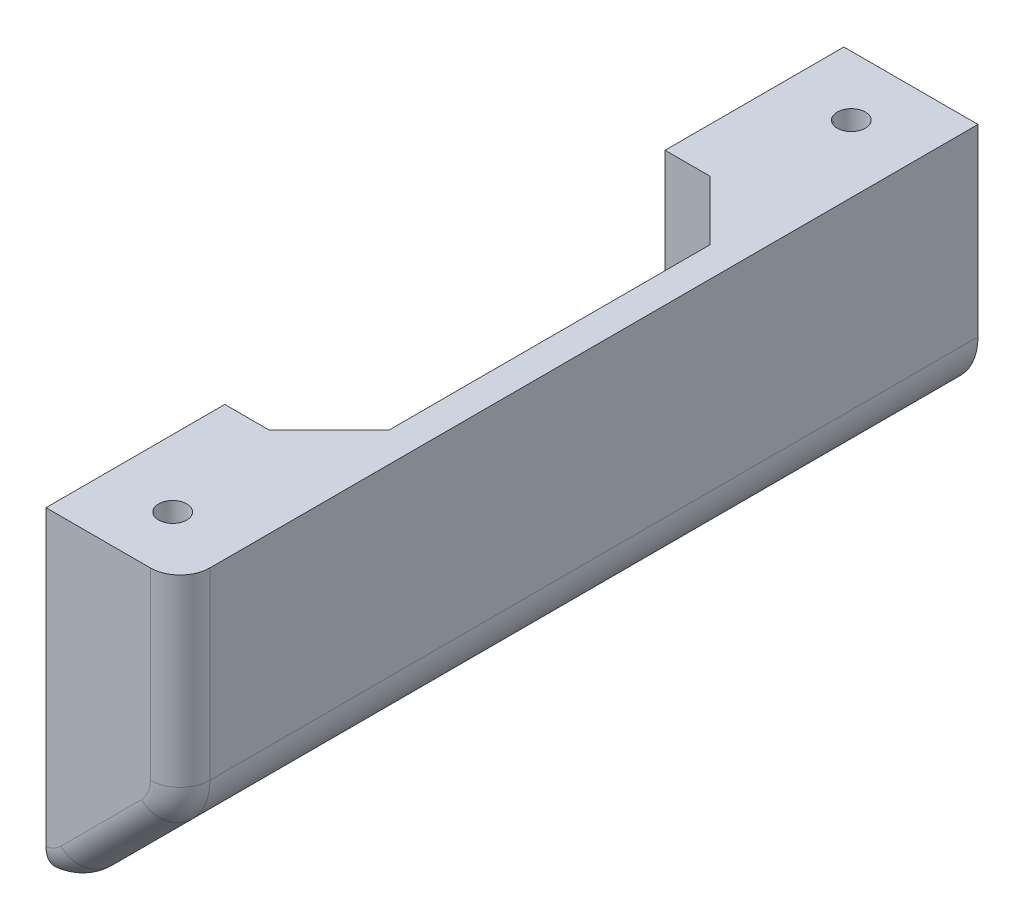
ISO-10303-21;
HEADER;
FILE_DESCRIPTION(('STEP AP214'),'2;1');
FILE_NAME('part.step','',(''),(''),'','','');
FILE_SCHEMA(('AUTOMOTIVE_DESIGN { 1 0 10303 214 1 1 1 1 }'));
ENDSEC;
DATA;
#1=APPLICATION_CONTEXT('core data for automotive mechanical design processes');
#2=APPLICATION_PROTOCOL_DEFINITION('international standard','automotive_design',2000,#1);
#3=PRODUCT_CONTEXT('',#1,'mechanical');
#4=PRODUCT('Part','Part','',(#3));
#5=PRODUCT_RELATED_PRODUCT_CATEGORY('part','',(#4));
#6=PRODUCT_DEFINITION_FORMATION('','',#4);
#7=PRODUCT_DEFINITION_CONTEXT('part definition',#1,'design');
#8=PRODUCT_DEFINITION('design','',#6,#7);
#9=PRODUCT_DEFINITION_SHAPE('','',#8);
#10=(LENGTH_UNIT() NAMED_UNIT(*) SI_UNIT(.MILLI.,.METRE.));
#11=(NAMED_UNIT(*) PLANE_ANGLE_UNIT() SI_UNIT($,.RADIAN.));
#12=(NAMED_UNIT(*) SI_UNIT($,.STERADIAN.) SOLID_ANGLE_UNIT());
#13=UNCERTAINTY_MEASURE_WITH_UNIT(LENGTH_MEASURE(1.E-05),#10,'distance_accuracy_value','');
#14=(GEOMETRIC_REPRESENTATION_CONTEXT(3) GLOBAL_UNCERTAINTY_ASSIGNED_CONTEXT((#13)) GLOBAL_UNIT_ASSIGNED_CONTEXT((#10,
#11,#12)) REPRESENTATION_CONTEXT('',''));
#15=CARTESIAN_POINT('',(0.,0.,0.));
#16=DIRECTION('',(0.,0.,1.));
#17=DIRECTION('',(1.,0.,0.));
#18=AXIS2_PLACEMENT_3D('',#15,#16,#17);
#19=CARTESIAN_POINT('',(-231.304465963193,68.999999999995,244.682867011122));
#20=DIRECTION('',(0.,-1.00000000000002,0.));
#21=DIRECTION('',(0.,0.,-1.00000000000003));
#22=AXIS2_PLACEMENT_3D('',#19,#20,#21);
#23=PLANE('',#22);
#24=CARTESIAN_POINT('',(-217.016965963193,69.0000000000029,12.6999999999988));
#25=DIRECTION('',(0.,1.00000000000002,0.));
#26=DIRECTION('',(0.,0.,1.00000000000003));
#27=AXIS2_PLACEMENT_3D('',#24,#25,#26);
#28=CIRCLE('',#27,2.99720000000001);
#29=CARTESIAN_POINT('',(-217.016965963193,69.0000000000028,15.6971999999989));
#30=VERTEX_POINT('',#29);
#31=EDGE_CURVE('E205',#30,#30,#28,.T.);
#32=ORIENTED_EDGE('',*,*,#31,.F.);
#33=EDGE_LOOP('',(#32));
#34=FACE_BOUND('',#33,.T.);
#35=CARTESIAN_POINT('',(-217.016965963193,68.9999999999994,157.300000000004));
#36=DIRECTION('',(0.,1.00000000000002,0.));
#37=DIRECTION('',(0.,0.,1.00000000000003));
#38=AXIS2_PLACEMENT_3D('',#35,#36,#37);
#39=CIRCLE('',#38,2.99720000000001);
#40=CARTESIAN_POINT('',(-217.016965963193,68.9999999999993,160.297200000004));
#41=VERTEX_POINT('',#40);
#42=EDGE_CURVE('E211',#41,#41,#39,.T.);
#43=ORIENTED_EDGE('',*,*,#42,.F.);
#44=EDGE_LOOP('',(#43));
#45=FACE_BOUND('',#44,.T.);
#46=DIRECTION('',(0.,0.,-1.00000000000003));
#47=VECTOR('',#46,1.);
#48=CARTESIAN_POINT('',(-209.079465963193,68.9999999999969,244.682867011122));
#49=LINE('',#48,#47);
#50=CARTESIAN_POINT('',(-209.079465963193,69.0000000000001,119.200000000002));
#51=VERTEX_POINT('',#50);
#52=CARTESIAN_POINT('',(-209.079465963193,69.0000000000029,50.7999999999996));
#53=VERTEX_POINT('',#52);
#54=EDGE_CURVE('E237',#51,#53,#49,.T.);
#55=ORIENTED_EDGE('',*,*,#54,.F.);
#56=DIRECTION('',(0.707106781186542,0.,-0.707106781186572));
#57=VECTOR('',#56,1.);
#58=CARTESIAN_POINT('',(-282.933399468751,68.9999999999973,193.053933505564));
#59=LINE('',#58,#57);
#60=CARTESIAN_POINT('',(-221.779465963192,68.9999999999998,131.900000000002));
#61=VERTEX_POINT('',#60);
#62=EDGE_CURVE('E390',#51,#61,#59,.F.);
#63=ORIENTED_EDGE('',*,*,#62,.T.);
#64=DIRECTION('',(-1.,0.,0.));
#65=VECTOR('',#64,1.);
#66=CARTESIAN_POINT('',(-202.727465963193,69.0000000000003,131.900000000003));
#67=LINE('',#66,#65);
#68=CARTESIAN_POINT('',(-231.304465963193,68.9999999999986,131.900000000003));
#69=VERTEX_POINT('',#68);
#70=EDGE_CURVE('E220',#61,#69,#67,.T.);
#71=ORIENTED_EDGE('',*,*,#70,.T.);
#72=DIRECTION('',(0.,0.,-1.00000000000003));
#73=VECTOR('',#72,1.);
#74=CARTESIAN_POINT('',(-231.304465963193,68.999999999995,244.682867011122));
#75=LINE('',#74,#73);
#76=CARTESIAN_POINT('',(-231.304465963193,68.9999999999969,170.000000000003));
#77=VERTEX_POINT('',#76);
#78=EDGE_CURVE('E252',#77,#69,#75,.T.);
#79=ORIENTED_EDGE('',*,*,#78,.F.);
#80=DIRECTION('',(-1.,0.,0.));
#81=VECTOR('',#80,1.);
#82=CARTESIAN_POINT('',(-231.304465963193,68.9999999999969,170.000000000003));
#83=LINE('',#82,#81);
#84=CARTESIAN_POINT('',(-209.079465963193,68.9999999999999,170.000000000003));
#85=VERTEX_POINT('',#84);
#86=EDGE_CURVE('E244',#85,#77,#83,.T.);
#87=ORIENTED_EDGE('',*,*,#86,.F.);
#88=CARTESIAN_POINT('',(-209.079465963193,68.9999999999999,163.650000000003));
#89=DIRECTION('',(0.,-1.00000000000002,0.));
#90=DIRECTION('',(0.,0.,-1.00000000000003));
#91=AXIS2_PLACEMENT_3D('',#88,#89,#90);
#92=CIRCLE('',#91,6.35);
#93=CARTESIAN_POINT('',(-202.729465963193,68.9999999999999,163.650000000003));
#94=VERTEX_POINT('',#93);
#95=EDGE_CURVE('E286',#85,#94,#92,.F.);
#96=ORIENTED_EDGE('',*,*,#95,.T.);
#97=DIRECTION('',(0.,0.,-1.00000000000003));
#98=VECTOR('',#97,1.);
#99=CARTESIAN_POINT('',(-202.729465963193,68.9999999999974,244.682867011123));
#100=LINE('',#99,#98);
#101=CARTESIAN_POINT('',(-202.729465963193,69.0000000000031,-2.3037127760972E-12));
#102=VERTEX_POINT('',#101);
#103=EDGE_CURVE('E235',#94,#102,#100,.T.);
#104=ORIENTED_EDGE('',*,*,#103,.T.);
#105=DIRECTION('',(-1.,0.,0.));
#106=VECTOR('',#105,1.);
#107=CARTESIAN_POINT('',(-231.304465963193,69.0000000000003,-2.02615701994091E-12));
#108=LINE('',#107,#106);
#109=CARTESIAN_POINT('',(-231.304465963193,69.0000000000003,-2.02615701994091E-12));
#110=VERTEX_POINT('',#109);
#111=EDGE_CURVE('E253',#102,#110,#108,.T.);
#112=ORIENTED_EDGE('',*,*,#111,.T.);
#113=CARTESIAN_POINT('',(-231.304465963193,69.0000000000006,38.0999999999994));
#114=VERTEX_POINT('',#113);
#115=EDGE_CURVE('E256',#114,#110,#75,.T.);
#116=ORIENTED_EDGE('',*,*,#115,.F.);
#117=DIRECTION('',(-1.,0.,0.));
#118=VECTOR('',#117,1.);
#119=CARTESIAN_POINT('',(-202.727465963193,69.0000000000007,38.0999999999996));
#120=LINE('',#119,#118);
#121=CARTESIAN_POINT('',(-221.779465963193,69.0000000000007,38.0999999999994));
#122=VERTEX_POINT('',#121);
#123=EDGE_CURVE('E222',#122,#114,#120,.T.);
#124=ORIENTED_EDGE('',*,*,#123,.F.);
#125=DIRECTION('',(-0.707106781186545,0.,-0.707106781186574));
#126=VECTOR('',#125,1.);
#127=CARTESIAN_POINT('',(-123.250532457634,68.9999999999997,136.628933505562));
#128=LINE('',#127,#126);
#129=EDGE_CURVE('E11',#122,#53,#128,.F.);
#130=ORIENTED_EDGE('',*,*,#129,.T.);
#131=EDGE_LOOP('',(#55,#63,#71,#79,#87,#96,#104,#112,#116,#124,#130));
#132=FACE_BOUND('',#131,.T.);
#133=ADVANCED_FACE('F38',(#34,#45,#132),#23,.F.);
#134=CARTESIAN_POINT('',(-231.304465963193,-5.99520433297585E-12,244.682867011125));
#135=DIRECTION('',(1.,0.,0.));
#136=DIRECTION('',(0.,0.,-1.00000000000003));
#137=AXIS2_PLACEMENT_3D('',#134,#135,#136);
#138=PLANE('',#137);
#139=CARTESIAN_POINT('',(-231.304465963193,34.4999999999966,141.425000000004));
#140=DIRECTION('',(-1.,0.,0.));
#141=DIRECTION('',(0.,0.,1.00000000000003));
#142=AXIS2_PLACEMENT_3D('',#139,#140,#141);
#143=CIRCLE('',#142,2.99720000000001);
#144=CARTESIAN_POINT('',(-231.304465963193,34.4999999999966,144.422200000004));
#145=VERTEX_POINT('',#144);
#146=EDGE_CURVE('E185',#145,#145,#143,.T.);
#147=ORIENTED_EDGE('',*,*,#146,.F.);
#148=EDGE_LOOP('',(#147));
#149=FACE_BOUND('',#148,.T.);
#150=CARTESIAN_POINT('',(-231.304465963193,34.5000000000005,19.0499999999998));
#151=DIRECTION('',(-1.,0.,0.));
#152=DIRECTION('',(0.,0.,1.00000000000003));
#153=AXIS2_PLACEMENT_3D('',#150,#151,#152);
#154=CIRCLE('',#153,2.99720000000001);
#155=CARTESIAN_POINT('',(-231.304465963193,34.5000000000004,22.0471999999999));
#156=VERTEX_POINT('',#155);
#157=EDGE_CURVE('E191',#156,#156,#154,.T.);
#158=ORIENTED_EDGE('',*,*,#157,.F.);
#159=EDGE_LOOP('',(#158));
#160=FACE_BOUND('',#159,.T.);
#161=DIRECTION('',(0.,-1.00000000000002,0.));
#162=VECTOR('',#161,1.);
#163=CARTESIAN_POINT('',(-231.304465963193,68.9999999999986,131.900000000003));
#164=LINE('',#163,#162);
#165=CARTESIAN_POINT('',(-231.304465963193,22.9157683632041,131.900000000004));
#166=VERTEX_POINT('',#165);
#167=EDGE_CURVE('E217',#69,#166,#164,.T.);
#168=ORIENTED_EDGE('',*,*,#167,.T.);
#169=DIRECTION('',(0.,0.816496580927722,0.577350269189628));
#170=VECTOR('',#169,1.);
#171=CARTESIAN_POINT('',(-231.304465963193,60.8049428312139,158.691692199893));
#172=LINE('',#171,#170);
#173=CARTESIAN_POINT('',(-231.304465963193,6.34999999999841,120.186232854813));
#174=VERTEX_POINT('',#173);
#175=EDGE_CURVE('E388',#166,#174,#172,.F.);
#176=ORIENTED_EDGE('',*,*,#175,.T.);
#177=DIRECTION('',(0.,0.,-1.00000000000003));
#178=VECTOR('',#177,1.);
#179=CARTESIAN_POINT('',(-231.304465963193,6.34999999999414,244.682867011124));
#180=LINE('',#179,#178);
#181=CARTESIAN_POINT('',(-231.304465963193,6.35000000000058,49.8137671451917));
#182=VERTEX_POINT('',#181);
#183=EDGE_CURVE('E232',#174,#182,#180,.T.);
#184=ORIENTED_EDGE('',*,*,#183,.T.);
#185=DIRECTION('',(0.,-0.816496580927757,0.577350269189665));
#186=VECTOR('',#185,1.);
#187=CARTESIAN_POINT('',(-231.304465963193,-89.7455079726159,117.763552474195));
#188=LINE('',#187,#186);
#189=CARTESIAN_POINT('',(-231.304465963193,22.9157683632074,38.1000000000012));
#190=VERTEX_POINT('',#189);
#191=EDGE_CURVE('E47',#182,#190,#188,.F.);
#192=ORIENTED_EDGE('',*,*,#191,.T.);
#193=DIRECTION('',(0.,1.00000000000002,0.));
#194=VECTOR('',#193,1.);
#195=CARTESIAN_POINT('',(-231.304465963193,69.0000000000006,38.0999999999994));
#196=LINE('',#195,#194);
#197=EDGE_CURVE('E223',#190,#114,#196,.T.);
#198=ORIENTED_EDGE('',*,*,#197,.T.);
#199=ORIENTED_EDGE('',*,*,#115,.T.);
#200=DIRECTION('',(0.,-1.00000000000002,0.));
#201=VECTOR('',#200,1.);
#202=CARTESIAN_POINT('',(-231.304465963193,-1.83186799063151E-12,-4.44089209850063E-13));
#203=LINE('',#202,#201);
#204=CARTESIAN_POINT('',(-231.304465963193,-1.83186799063151E-12,-4.44089209850063E-13));
#205=VERTEX_POINT('',#204);
#206=EDGE_CURVE('E249',#110,#205,#203,.T.);
#207=ORIENTED_EDGE('',*,*,#206,.T.);
#208=DIRECTION('',(0.,0.,-1.00000000000003));
#209=VECTOR('',#208,1.);
#210=CARTESIAN_POINT('',(-231.304465963193,-5.99520433297585E-12,244.682867011125));
#211=LINE('',#210,#209);
#212=CARTESIAN_POINT('',(-231.304465963193,-4.27435864480685E-12,163.650000000006));
#213=VERTEX_POINT('',#212);
#214=EDGE_CURVE('E248',#213,#205,#211,.T.);
#215=ORIENTED_EDGE('',*,*,#214,.F.);
#216=CARTESIAN_POINT('',(-231.304465963193,-4.27435864480685E-12,163.650000000006));
#217=CARTESIAN_POINT('',(-231.304465963193,-1.94645770757467E-05,163.827803696936));
#218=CARTESIAN_POINT('',(-231.304465963193,0.00750667465530277,164.005604471068));
#219=CARTESIAN_POINT('',(-231.304465963193,0.0375094933216349,164.359930980728));
#220=CARTESIAN_POINT('',(-231.304465963193,0.0599853722420327,164.536456784015));
#221=CARTESIAN_POINT('',(-231.304465963193,0.119721245651942,164.886832228509));
#222=CARTESIAN_POINT('',(-231.304465963193,0.156968465712378,165.060684047614));
#223=CARTESIAN_POINT('',(-231.304465963193,0.245971625259334,165.404630889584));
#224=CARTESIAN_POINT('',(-231.304465963193,0.297727401614616,165.574725954666));
#225=CARTESIAN_POINT('',(-231.304465963193,0.415391932509909,165.91000029629));
#226=CARTESIAN_POINT('',(-231.304465963193,0.481304540635156,166.075178220385));
#227=CARTESIAN_POINT('',(-231.304465963193,0.626825096140965,166.399459779302));
#228=CARTESIAN_POINT('',(-231.304465963193,0.706438076853262,166.558561155338));
#229=CARTESIAN_POINT('',(-231.304465963193,0.878739451229018,166.869448719972));
#230=CARTESIAN_POINT('',(-231.304465963193,0.971423457824445,167.021237340132));
#231=CARTESIAN_POINT('',(-231.304465963193,1.1692218431034,167.316491773834));
#232=CARTESIAN_POINT('',(-231.304465963193,1.27433652144187,167.459957386616));
#233=CARTESIAN_POINT('',(-231.304465963193,1.49639703833522,167.737755205205));
#234=CARTESIAN_POINT('',(-231.304465963193,1.61335952648075,167.872074101573));
#235=CARTESIAN_POINT('',(-231.304465963193,1.8581490779321,168.130416736262));
#236=CARTESIAN_POINT('',(-231.304465963192,1.98597615876931,168.25444045797));
#237=CARTESIAN_POINT('',(-231.304465963193,2.25159440056227,168.491349975785));
#238=CARTESIAN_POINT('',(-231.304465963193,2.38938684412215,168.60423433375));
#239=CARTESIAN_POINT('',(-231.304465963192,2.67393253722205,168.818073507177));
#240=CARTESIAN_POINT('',(-231.30446596319,2.82068567265383,168.919028474504));
#241=CARTESIAN_POINT('',(-231.30446596319,3.12285855333904,169.108802472057));
#242=CARTESIAN_POINT('',(-231.304465963192,3.27831774549394,169.197558695213));
#243=CARTESIAN_POINT('',(-231.304465963193,3.59606019387105,169.361721397575));
#244=CARTESIAN_POINT('',(-231.304465963193,3.75834108404915,169.437132458914));
#245=CARTESIAN_POINT('',(-231.304465963192,4.08862458887821,169.574158611998));
#246=CARTESIAN_POINT('',(-231.304465963193,4.25662696477025,169.635774278617));
#247=CARTESIAN_POINT('',(-231.304465963193,4.59710267552029,169.744829591519));
#248=CARTESIAN_POINT('',(-231.304465963193,4.76957507651727,169.792272173255));
#249=CARTESIAN_POINT('',(-231.304465963193,5.18540606108045,169.888337439605));
#250=CARTESIAN_POINT('',(-231.304465963193,5.43035077198521,169.930302426443));
#251=CARTESIAN_POINT('',(-231.304465963193,5.79978470029608,169.972170078542));
#252=CARTESIAN_POINT('',(-231.304465963193,5.92318413234367,169.982612703534));
#253=CARTESIAN_POINT('',(-231.304465963193,6.17039476212908,169.996527939177));
#254=CARTESIAN_POINT('',(-231.304465963193,6.29420601995016,169.999999483697));
#255=CARTESIAN_POINT('',(-231.304465963193,6.4180481275008,170.000000000005));
#256=B_SPLINE_CURVE_WITH_KNOTS('',3,(#216,#217,#218,#219,#220,#221,#222,#223,#224,#225,#226,
#227,#228,#229,#230,#231,#232,#233,#234,#235,#236,#237,#238,#239,#240,#241,#242,#243,#244,#245,
#246,#247,#248,#249,#250,#251,#252,#253,#254,#255),.UNSPECIFIED.,.F.,.F.,(4,2,2,2,2,2,2,2,2,2,2,
2,2,2,2,2,2,2,2,4),(0.,0.533247724383543,1.06646689725518,1.59922593802521,2.13197898880193,
2.66487724276656,3.19797169595402,3.73088764898342,4.26381645115453,4.79750484489828,
5.33119409983196,5.86495216655266,6.39870343764889,6.93510736260423,7.47132675147941,
8.00752379114796,8.5436096994168,9.28729610396529,9.65865392644171,10.0300685386412),.UNSPECIFIED.);
#257=CARTESIAN_POINT('',(-231.304465963193,6.4180481275008,170.000000000005));
#258=VERTEX_POINT('',#257);
#259=EDGE_CURVE('E296',#213,#258,#256,.T.);
#260=ORIENTED_EDGE('',*,*,#259,.T.);
#261=DIRECTION('',(0.,-1.00000000000002,0.));
#262=VECTOR('',#261,1.);
#263=CARTESIAN_POINT('',(-231.304465963193,-3.5527136788005E-12,170.000000000006));
#264=LINE('',#263,#262);
#265=EDGE_CURVE('E257',#77,#258,#264,.T.);
#266=ORIENTED_EDGE('',*,*,#265,.F.);
#267=ORIENTED_EDGE('',*,*,#78,.T.);
#268=EDGE_LOOP('',(#168,#176,#184,#192,#198,#199,#207,#215,#260,#266,#267));
#269=FACE_BOUND('',#268,.T.);
#270=ADVANCED_FACE('F310',(#149,#160,#269),#138,.F.);
#271=CARTESIAN_POINT('',(-202.729465963193,24.5499999999985,244.682867011124));
#272=DIRECTION('',(-0.707106781186537,0.70710678118656,0.));
#273=DIRECTION('',(-0.70710678118656,-0.707106781186568,0.));
#274=AXIS2_PLACEMENT_3D('',#271,#272,#273);
#275=PLANE('',#274);
#276=DIRECTION('',(0.,0.,-1.00000000000003));
#277=VECTOR('',#276,1.);
#278=CARTESIAN_POINT('',(-206.449209842123,20.8302561210645,244.682867011124));
#279=LINE('',#278,#277);
#280=CARTESIAN_POINT('',(-206.449209842124,20.8302561210723,-6.38378239159465E-13));
#281=VERTEX_POINT('',#280);
#282=CARTESIAN_POINT('',(-206.449209842123,20.8302561210666,163.650000000004));
#283=VERTEX_POINT('',#282);
#284=EDGE_CURVE('E274',#281,#283,#279,.F.);
#285=ORIENTED_EDGE('',*,*,#284,.T.);
#286=DIRECTION('',(0.70710678118656,0.707106781186568,0.));
#287=VECTOR('',#286,1.);
#288=CARTESIAN_POINT('',(-223.626687979078,3.65277798411262,163.650000000005));
#289=LINE('',#288,#287);
#290=CARTESIAN_POINT('',(-223.626687979078,3.6527779841124,163.650000000005));
#291=VERTEX_POINT('',#290);
#292=EDGE_CURVE('E292',#283,#291,#289,.F.);
#293=ORIENTED_EDGE('',*,*,#292,.T.);
#294=DIRECTION('',(0.,0.,-1.00000000000003));
#295=VECTOR('',#294,1.);
#296=CARTESIAN_POINT('',(-223.626687979078,3.65277798411068,244.682867011124));
#297=LINE('',#296,#295);
#298=CARTESIAN_POINT('',(-223.626687979079,3.65277798411751,-3.88578058618805E-13));
#299=VERTEX_POINT('',#298);
#300=EDGE_CURVE('E272',#291,#299,#297,.T.);
#301=ORIENTED_EDGE('',*,*,#300,.T.);
#302=DIRECTION('',(0.70710678118656,0.707106781186568,0.));
#303=VECTOR('',#302,1.);
#304=CARTESIAN_POINT('',(-202.729465963193,24.5500000000023,-1.11022302462516E-13));
#305=LINE('',#304,#303);
#306=EDGE_CURVE('E245',#299,#281,#305,.T.);
#307=ORIENTED_EDGE('',*,*,#306,.T.);
#308=EDGE_LOOP('',(#285,#293,#301,#307));
#309=FACE_BOUND('',#308,.T.);
#310=ADVANCED_FACE('F315',(#309),#275,.F.);
#311=CARTESIAN_POINT('',(-202.729465963193,68.9999999999974,244.682867011123));
#312=DIRECTION('',(-1.,0.,0.));
#313=DIRECTION('',(0.,-1.00000000000002,0.));
#314=AXIS2_PLACEMENT_3D('',#311,#312,#313);
#315=PLANE('',#314);
#316=ORIENTED_EDGE('',*,*,#103,.F.);
#317=DIRECTION('',(0.,1.00000000000002,0.));
#318=VECTOR('',#317,1.);
#319=CARTESIAN_POINT('',(-202.72946596319,29.8105122421354,163.650000000004));
#320=LINE('',#319,#318);
#321=CARTESIAN_POINT('',(-202.72946596319,29.8105122421354,163.650000000004));
#322=VERTEX_POINT('',#321);
#323=EDGE_CURVE('E288',#94,#322,#320,.F.);
#324=ORIENTED_EDGE('',*,*,#323,.T.);
#325=DIRECTION('',(0.,0.,-1.00000000000003));
#326=VECTOR('',#325,1.);
#327=CARTESIAN_POINT('',(-202.729465963193,29.8105122421351,244.682867011124));
#328=LINE('',#327,#326);
#329=CARTESIAN_POINT('',(-202.729465963193,29.8105122421405,-1.08246744900953E-12));
#330=VERTEX_POINT('',#329);
#331=EDGE_CURVE('E260',#322,#330,#328,.T.);
#332=ORIENTED_EDGE('',*,*,#331,.T.);
#333=DIRECTION('',(0.,1.00000000000002,0.));
#334=VECTOR('',#333,1.);
#335=CARTESIAN_POINT('',(-202.729465963193,69.0000000000031,-2.3037127760972E-12));
#336=LINE('',#335,#334);
#337=EDGE_CURVE('E241',#330,#102,#336,.T.);
#338=ORIENTED_EDGE('',*,*,#337,.T.);
#339=EDGE_LOOP('',(#316,#324,#332,#338));
#340=FACE_BOUND('',#339,.T.);
#341=ADVANCED_FACE('F421',(#340),#315,.F.);
#342=CARTESIAN_POINT('',(0.,0.,0.));
#343=DIRECTION('',(0.,0.,-1.00000000000003));
#344=DIRECTION('',(-1.,0.,0.));
#345=AXIS2_PLACEMENT_3D('',#342,#343,#344);
#346=PLANE('',#345);
#347=ORIENTED_EDGE('',*,*,#337,.F.);
#348=CARTESIAN_POINT('',(-215.429465963193,29.8105122421409,-5.55111512312578E-13));
#349=DIRECTION('',(0.,0.,-1.00000000000003));
#350=DIRECTION('',(-1.,0.,0.));
#351=AXIS2_PLACEMENT_3D('',#348,#349,#350);
#352=CIRCLE('',#351,12.7);
#353=EDGE_CURVE('E270',#330,#281,#352,.T.);
#354=ORIENTED_EDGE('',*,*,#353,.T.);
#355=ORIENTED_EDGE('',*,*,#306,.F.);
#356=CARTESIAN_POINT('',(-232.606944100148,12.6330341051865,-6.10622663543836E-13));
#357=DIRECTION('',(0.,0.,-1.00000000000003));
#358=DIRECTION('',(-1.,0.,0.));
#359=AXIS2_PLACEMENT_3D('',#356,#357,#358);
#360=CIRCLE('',#359,12.7);
#361=EDGE_CURVE('E267',#299,#205,#360,.T.);
#362=ORIENTED_EDGE('',*,*,#361,.T.);
#363=ORIENTED_EDGE('',*,*,#206,.F.);
#364=ORIENTED_EDGE('',*,*,#111,.F.);
#365=EDGE_LOOP('',(#347,#354,#355,#362,#363,#364));
#366=FACE_BOUND('',#365,.T.);
#367=ADVANCED_FACE('F325',(#366),#346,.T.);
#368=CARTESIAN_POINT('',(-3.60822483003176E-13,-2.22044604925031E-12,170.000000000006));
#369=DIRECTION('',(0.,0.,1.00000000000003));
#370=DIRECTION('',(1.,0.,0.));
#371=AXIS2_PLACEMENT_3D('',#368,#369,#370);
#372=PLANE('',#371);
#373=CARTESIAN_POINT('',(-215.429465963192,29.8105122421367,170.000000000005));
#374=DIRECTION('',(0.,0.,1.00000000000003));
#375=DIRECTION('',(1.,0.,0.));
#376=AXIS2_PLACEMENT_3D('',#373,#374,#375);
#377=CIRCLE('',#376,6.35);
#378=CARTESIAN_POINT('',(-210.939337902658,25.3203841816031,170.000000000005));
#379=VERTEX_POINT('',#378);
#380=CARTESIAN_POINT('',(-209.079465963192,29.810512242136,170.000000000004));
#381=VERTEX_POINT('',#380);
#382=EDGE_CURVE('E281',#379,#381,#377,.T.);
#383=ORIENTED_EDGE('',*,*,#382,.T.);
#384=DIRECTION('',(0.,1.00000000000002,0.));
#385=VECTOR('',#384,1.);
#386=CARTESIAN_POINT('',(-209.079465963193,68.9999999999999,170.000000000003));
#387=LINE('',#386,#385);
#388=EDGE_CURVE('E283',#381,#85,#387,.T.);
#389=ORIENTED_EDGE('',*,*,#388,.T.);
#390=ORIENTED_EDGE('',*,*,#86,.T.);
#391=ORIENTED_EDGE('',*,*,#265,.T.);
#392=CARTESIAN_POINT('',(-232.606944100144,12.6330341051798,170.000000000006));
#393=DIRECTION('',(0.,0.,1.00000000000003));
#394=DIRECTION('',(1.,0.,0.));
#395=AXIS2_PLACEMENT_3D('',#392,#393,#394);
#396=CIRCLE('',#395,6.35);
#397=CARTESIAN_POINT('',(-228.116816039613,8.14290604464696,170.000000000005));
#398=VERTEX_POINT('',#397);
#399=EDGE_CURVE('E277',#258,#398,#396,.T.);
#400=ORIENTED_EDGE('',*,*,#399,.T.);
#401=DIRECTION('',(0.70710678118656,0.707106781186568,0.));
#402=VECTOR('',#401,1.);
#403=CARTESIAN_POINT('',(-210.939337902658,25.3203841816031,170.000000000005));
#404=LINE('',#403,#402);
#405=EDGE_CURVE('E279',#398,#379,#404,.T.);
#406=ORIENTED_EDGE('',*,*,#405,.T.);
#407=EDGE_LOOP('',(#383,#389,#390,#391,#400,#406));
#408=FACE_BOUND('',#407,.T.);
#409=ADVANCED_FACE('F321',(#408),#372,.T.);
#410=CARTESIAN_POINT('',(-227.279465963194,6.34999999999569,244.682867011124));
#411=DIRECTION('',(0.,1.00000000000002,0.));
#412=DIRECTION('',(-1.,0.,0.));
#413=AXIS2_PLACEMENT_3D('',#410,#411,#412);
#414=PLANE('',#413);
#415=ORIENTED_EDGE('',*,*,#183,.F.);
#416=DIRECTION('',(-0.816496580927723,0.,0.577350269189641));
#417=VECTOR('',#416,1.);
#418=CARTESIAN_POINT('',(-287.309408794411,6.34999999999525,159.787707710734));
#419=LINE('',#418,#417);
#420=CARTESIAN_POINT('',(-229.909722084263,6.34999999999813,119.200000000003));
#421=VERTEX_POINT('',#420);
#422=EDGE_CURVE('E379',#174,#421,#419,.F.);
#423=ORIENTED_EDGE('',*,*,#422,.T.);
#424=DIRECTION('',(0.,0.,-1.00000000000003));
#425=VECTOR('',#424,1.);
#426=CARTESIAN_POINT('',(-229.909722084263,6.34999999999458,244.682867011124));
#427=LINE('',#426,#425);
#428=CARTESIAN_POINT('',(-229.909722084263,6.34999999999702,50.8000000000011));
#429=VERTEX_POINT('',#428);
#430=EDGE_CURVE('E228',#421,#429,#427,.T.);
#431=ORIENTED_EDGE('',*,*,#430,.T.);
#432=DIRECTION('',(0.816496580927727,0.,0.577350269189643));
#433=VECTOR('',#432,1.);
#434=CARTESIAN_POINT('',(-136.758957990583,6.34999999999691,116.667536963353));
#435=LINE('',#434,#433);
#436=EDGE_CURVE('E377',#429,#182,#435,.F.);
#437=ORIENTED_EDGE('',*,*,#436,.T.);
#438=EDGE_LOOP('',(#415,#423,#431,#437));
#439=FACE_BOUND('',#438,.T.);
#440=ADVANCED_FACE('F324',(#439),#414,.T.);
#441=CARTESIAN_POINT('',(-207.219594023727,29.0401280605304,244.682867011124));
#442=DIRECTION('',(-0.707106781186537,0.70710678118656,0.));
#443=DIRECTION('',(-0.70710678118656,-0.707106781186568,0.));
#444=AXIS2_PLACEMENT_3D('',#441,#442,#443);
#445=PLANE('',#444);
#446=ORIENTED_EDGE('',*,*,#430,.F.);
#447=DIRECTION('',(0.70710678118656,0.707106781186568,0.));
#448=VECTOR('',#447,1.);
#449=CARTESIAN_POINT('',(-209.079465963193,27.1802561210679,119.200000000003));
#450=LINE('',#449,#448);
#451=CARTESIAN_POINT('',(-209.079465963193,27.1802561210679,119.200000000003));
#452=VERTEX_POINT('',#451);
#453=EDGE_CURVE('E370',#421,#452,#450,.T.);
#454=ORIENTED_EDGE('',*,*,#453,.T.);
#455=DIRECTION('',(0.,0.,-1.00000000000003));
#456=VECTOR('',#455,1.);
#457=CARTESIAN_POINT('',(-209.079465963193,27.1802561210646,244.682867011124));
#458=LINE('',#457,#456);
#459=CARTESIAN_POINT('',(-209.079465963193,27.1802561210711,50.8000000000006));
#460=VERTEX_POINT('',#459);
#461=EDGE_CURVE('E231',#452,#460,#458,.T.);
#462=ORIENTED_EDGE('',*,*,#461,.T.);
#463=DIRECTION('',(-0.70710678118656,-0.707106781186568,0.));
#464=VECTOR('',#463,1.);
#465=CARTESIAN_POINT('',(-229.909722084263,6.34999999999691,50.8000000000011));
#466=LINE('',#465,#464);
#467=EDGE_CURVE('E304',#460,#429,#466,.T.);
#468=ORIENTED_EDGE('',*,*,#467,.T.);
#469=EDGE_LOOP('',(#446,#454,#462,#468));
#470=FACE_BOUND('',#469,.T.);
#471=ADVANCED_FACE('F443',(#470),#445,.T.);
#472=CARTESIAN_POINT('',(-209.079465963193,68.9999999999969,244.682867011122));
#473=DIRECTION('',(-1.,0.,0.));
#474=DIRECTION('',(0.,-1.00000000000002,0.));
#475=AXIS2_PLACEMENT_3D('',#472,#473,#474);
#476=PLANE('',#475);
#477=ORIENTED_EDGE('',*,*,#461,.F.);
#478=DIRECTION('',(0.,1.00000000000002,0.));
#479=VECTOR('',#478,1.);
#480=CARTESIAN_POINT('',(-209.079465963193,69.0000000000001,119.200000000002));
#481=LINE('',#480,#479);
#482=EDGE_CURVE('E383',#452,#51,#481,.T.);
#483=ORIENTED_EDGE('',*,*,#482,.T.);
#484=ORIENTED_EDGE('',*,*,#54,.T.);
#485=DIRECTION('',(0.,-1.00000000000002,0.));
#486=VECTOR('',#485,1.);
#487=CARTESIAN_POINT('',(-209.079465963193,27.1802561210716,50.8000000000007));
#488=LINE('',#487,#486);
#489=EDGE_CURVE('E381',#53,#460,#488,.T.);
#490=ORIENTED_EDGE('',*,*,#489,.T.);
#491=EDGE_LOOP('',(#477,#483,#484,#490));
#492=FACE_BOUND('',#491,.T.);
#493=ADVANCED_FACE('F331',(#492),#476,.T.);
#494=CARTESIAN_POINT('',(-215.429465963193,29.8105122421322,244.682867011124));
#495=DIRECTION('',(0.,0.,-1.00000000000003));
#496=DIRECTION('',(-1.,0.,0.));
#497=AXIS2_PLACEMENT_3D('',#494,#495,#496);
#498=CYLINDRICAL_SURFACE('',#497,12.7);
#499=ORIENTED_EDGE('',*,*,#331,.F.);
#500=CARTESIAN_POINT('',(-215.42946596319,29.8105122421373,163.650000000004));
#501=DIRECTION('',(0.,0.,1.00000000000003));
#502=DIRECTION('',(1.,0.,0.));
#503=AXIS2_PLACEMENT_3D('',#500,#501,#502);
#504=CIRCLE('',#503,12.7);
#505=EDGE_CURVE('E290',#322,#283,#504,.F.);
#506=ORIENTED_EDGE('',*,*,#505,.T.);
#507=ORIENTED_EDGE('',*,*,#284,.F.);
#508=ORIENTED_EDGE('',*,*,#353,.F.);
#509=EDGE_LOOP('',(#499,#506,#507,#508));
#510=FACE_BOUND('',#509,.T.);
#511=ADVANCED_FACE('F327',(#510),#498,.T.);
#512=CARTESIAN_POINT('',(-232.606944100147,12.6330341051778,244.682867011124));
#513=DIRECTION('',(0.,0.,-1.00000000000003));
#514=DIRECTION('',(-1.,0.,0.));
#515=AXIS2_PLACEMENT_3D('',#512,#513,#514);
#516=CYLINDRICAL_SURFACE('',#515,12.7);
#517=ORIENTED_EDGE('',*,*,#300,.F.);
#518=CARTESIAN_POINT('',(-232.606944100147,12.6330341051804,163.650000000005));
#519=DIRECTION('',(0.,0.,1.00000000000003));
#520=DIRECTION('',(1.,0.,0.));
#521=AXIS2_PLACEMENT_3D('',#518,#519,#520);
#522=CIRCLE('',#521,12.7);
#523=EDGE_CURVE('E294',#291,#213,#522,.F.);
#524=ORIENTED_EDGE('',*,*,#523,.T.);
#525=ORIENTED_EDGE('',*,*,#214,.T.);
#526=ORIENTED_EDGE('',*,*,#361,.F.);
#527=EDGE_LOOP('',(#517,#524,#525,#526));
#528=FACE_BOUND('',#527,.T.);
#529=ADVANCED_FACE('F330',(#528),#516,.T.);
#530=CARTESIAN_POINT('',(-232.606944100147,12.6330341051804,163.650000000005));
#531=DIRECTION('',(0.,0.,1.00000000000003));
#532=DIRECTION('',(1.,0.,0.));
#533=AXIS2_PLACEMENT_3D('',#530,#531,#532);
#534=DEGENERATE_TOROIDAL_SURFACE('',#533,6.35,6.35,.T.);
#535=ORIENTED_EDGE('',*,*,#259,.F.);
#536=ORIENTED_EDGE('',*,*,#523,.F.);
#537=CARTESIAN_POINT('',(-228.116816039613,8.14290604464585,163.650000000005));
#538=DIRECTION('',(0.707106781186561,0.707106781186568,0.));
#539=DIRECTION('',(-0.707106781186534,0.707106781186562,0.));
#540=AXIS2_PLACEMENT_3D('',#537,#538,#539);
#541=CIRCLE('',#540,6.35);
#542=EDGE_CURVE('E240',#398,#291,#541,.T.);
#543=ORIENTED_EDGE('',*,*,#542,.F.);
#544=ORIENTED_EDGE('',*,*,#399,.F.);
#545=EDGE_LOOP('',(#535,#536,#543,#544));
#546=FACE_BOUND('',#545,.T.);
#547=ADVANCED_FACE('F306',(#546),#534,.T.);
#548=CARTESIAN_POINT('',(-118.129861042132,118.129861042131,163.650000000002));
#549=DIRECTION('',(-0.70710678118656,-0.707106781186568,0.));
#550=DIRECTION('',(0.707106781186537,-0.70710678118656,0.));
#551=AXIS2_PLACEMENT_3D('',#548,#549,#550);
#552=CYLINDRICAL_SURFACE('',#551,6.35);
#553=ORIENTED_EDGE('',*,*,#542,.T.);
#554=ORIENTED_EDGE('',*,*,#292,.F.);
#555=CARTESIAN_POINT('',(-210.939337902658,25.3203841816029,163.650000000005));
#556=DIRECTION('',(0.70710678118656,0.707106781186568,0.));
#557=DIRECTION('',(-0.707106781186538,0.70710678118656,0.));
#558=AXIS2_PLACEMENT_3D('',#555,#556,#557);
#559=CIRCLE('',#558,6.35);
#560=EDGE_CURVE('E359',#379,#283,#559,.T.);
#561=ORIENTED_EDGE('',*,*,#560,.F.);
#562=ORIENTED_EDGE('',*,*,#405,.F.);
#563=EDGE_LOOP('',(#553,#554,#561,#562));
#564=FACE_BOUND('',#563,.T.);
#565=ADVANCED_FACE('F343',(#564),#552,.T.);
#566=CARTESIAN_POINT('',(-215.42946596319,29.8105122421373,163.650000000004));
#567=DIRECTION('',(0.,0.,1.00000000000003));
#568=DIRECTION('',(1.,0.,0.));
#569=AXIS2_PLACEMENT_3D('',#566,#567,#568);
#570=DEGENERATE_TOROIDAL_SURFACE('',#569,6.35,6.35,.T.);
#571=ORIENTED_EDGE('',*,*,#560,.T.);
#572=ORIENTED_EDGE('',*,*,#505,.F.);
#573=CARTESIAN_POINT('',(-209.07946596319,29.8105122421363,163.650000000004));
#574=DIRECTION('',(0.,1.00000000000002,0.));
#575=DIRECTION('',(-1.,0.,0.));
#576=AXIS2_PLACEMENT_3D('',#573,#574,#575);
#577=CIRCLE('',#576,6.35);
#578=EDGE_CURVE('E225',#381,#322,#577,.T.);
#579=ORIENTED_EDGE('',*,*,#578,.F.);
#580=ORIENTED_EDGE('',*,*,#382,.F.);
#581=EDGE_LOOP('',(#571,#572,#579,#580));
#582=FACE_BOUND('',#581,.T.);
#583=ADVANCED_FACE('F340',(#582),#570,.T.);
#584=CARTESIAN_POINT('',(-209.079465963193,-2.38697950294409E-12,163.650000000005));
#585=DIRECTION('',(0.,-1.00000000000002,0.));
#586=DIRECTION('',(1.,0.,0.));
#587=AXIS2_PLACEMENT_3D('',#584,#585,#586);
#588=CYLINDRICAL_SURFACE('',#587,6.35);
#589=ORIENTED_EDGE('',*,*,#578,.T.);
#590=ORIENTED_EDGE('',*,*,#323,.F.);
#591=ORIENTED_EDGE('',*,*,#95,.F.);
#592=ORIENTED_EDGE('',*,*,#388,.F.);
#593=EDGE_LOOP('',(#589,#590,#591,#592));
#594=FACE_BOUND('',#593,.T.);
#595=ADVANCED_FACE('F336',(#594),#588,.T.);
#596=CARTESIAN_POINT('',(-202.727465963193,69.0000000000007,38.0999999999996));
#597=DIRECTION('',(0.,0.,1.00000000000003));
#598=DIRECTION('',(0.,-1.00000000000002,0.));
#599=AXIS2_PLACEMENT_3D('',#596,#597,#598);
#600=PLANE('',#599);
#601=ORIENTED_EDGE('',*,*,#197,.F.);
#602=DIRECTION('',(0.70710678118656,0.707106781186569,0.));
#603=VECTOR('',#602,1.);
#604=CARTESIAN_POINT('',(-218.059722084262,36.1605122421404,38.0999999999999));
#605=LINE('',#604,#603);
#606=CARTESIAN_POINT('',(-221.779465963193,32.4407683632071,38.1000000000001));
#607=VERTEX_POINT('',#606);
#608=EDGE_CURVE('E55',#190,#607,#605,.T.);
#609=ORIENTED_EDGE('',*,*,#608,.T.);
#610=DIRECTION('',(0.,1.00000000000002,0.));
#611=VECTOR('',#610,1.);
#612=CARTESIAN_POINT('',(-221.779465963193,69.0000000000007,38.0999999999994));
#613=LINE('',#612,#611);
#614=EDGE_CURVE('E385',#607,#122,#613,.T.);
#615=ORIENTED_EDGE('',*,*,#614,.T.);
#616=ORIENTED_EDGE('',*,*,#123,.T.);
#617=EDGE_LOOP('',(#601,#609,#615,#616));
#618=FACE_BOUND('',#617,.T.);
#619=ADVANCED_FACE('F339',(#618),#600,.T.);
#620=CARTESIAN_POINT('',(-202.727465963193,69.0000000000003,131.900000000003));
#621=DIRECTION('',(0.,0.,-1.00000000000003));
#622=DIRECTION('',(-1.,0.,0.));
#623=AXIS2_PLACEMENT_3D('',#620,#621,#622);
#624=PLANE('',#623);
#625=DIRECTION('',(0.,-1.00000000000002,0.));
#626=VECTOR('',#625,1.);
#627=CARTESIAN_POINT('',(-221.779465963192,27.1802561210668,131.900000000004));
#628=LINE('',#627,#626);
#629=CARTESIAN_POINT('',(-221.779465963192,32.4407683632056,131.900000000003));
#630=VERTEX_POINT('',#629);
#631=EDGE_CURVE('E373',#61,#630,#628,.T.);
#632=ORIENTED_EDGE('',*,*,#631,.T.);
#633=DIRECTION('',(-0.70710678118656,-0.707106781186569,0.));
#634=VECTOR('',#633,1.);
#635=CARTESIAN_POINT('',(-238.889978205332,15.3302561210685,131.900000000005));
#636=LINE('',#635,#634);
#637=EDGE_CURVE('E375',#630,#166,#636,.T.);
#638=ORIENTED_EDGE('',*,*,#637,.T.);
#639=ORIENTED_EDGE('',*,*,#167,.F.);
#640=ORIENTED_EDGE('',*,*,#70,.F.);
#641=EDGE_LOOP('',(#632,#638,#639,#640));
#642=FACE_BOUND('',#641,.T.);
#643=ADVANCED_FACE('F402',(#642),#624,.T.);
#644=CARTESIAN_POINT('',(-217.016965963193,64.3010000000002,157.300000000003));
#645=DIRECTION('',(0.,-1.00000000000002,0.));
#646=DIRECTION('',(0.,0.,-1.00000000000003));
#647=AXIS2_PLACEMENT_3D('',#644,#645,#646);
#648=PLANE('',#647);
#649=CARTESIAN_POINT('',(-217.016965963193,64.3010000000002,157.300000000003));
#650=DIRECTION('',(0.,-1.00000000000002,0.));
#651=DIRECTION('',(0.,0.,-1.00000000000003));
#652=AXIS2_PLACEMENT_3D('',#649,#650,#651);
#653=CIRCLE('',#652,2.45745);
#654=CARTESIAN_POINT('',(-217.016965963193,64.3010000000003,154.842550000003));
#655=VERTEX_POINT('',#654);
#656=EDGE_CURVE('E200',#655,#655,#653,.T.);
#657=ORIENTED_EDGE('',*,*,#656,.T.);
#658=EDGE_LOOP('',(#657));
#659=FACE_BOUND('',#658,.T.);
#660=CARTESIAN_POINT('',(-217.016965963193,64.3010000000002,157.300000000003));
#661=DIRECTION('',(0.,1.00000000000002,0.));
#662=DIRECTION('',(0.,0.,1.00000000000003));
#663=AXIS2_PLACEMENT_3D('',#660,#661,#662);
#664=CIRCLE('',#663,2.87020000000002);
#665=CARTESIAN_POINT('',(-217.016965963193,64.3010000000001,160.170200000003));
#666=VERTEX_POINT('',#665);
#667=EDGE_CURVE('E214',#666,#666,#664,.T.);
#668=ORIENTED_EDGE('',*,*,#667,.T.);
#669=EDGE_LOOP('',(#668));
#670=FACE_BOUND('',#669,.T.);
#671=ADVANCED_FACE('F546',(#659,#670),#648,.F.);
#672=CARTESIAN_POINT('',(-217.016965963193,68.9999999999994,157.300000000004));
#673=DIRECTION('',(0.,1.00000000000002,0.));
#674=DIRECTION('',(0.,0.,1.00000000000003));
#675=AXIS2_PLACEMENT_3D('',#672,#673,#674);
#676=CONICAL_SURFACE('',#675,2.99720000000001,0.0270204491872623);
#677=ORIENTED_EDGE('',*,*,#667,.F.);
#678=EDGE_LOOP('',(#677));
#679=FACE_BOUND('',#678,.T.);
#680=ORIENTED_EDGE('',*,*,#42,.T.);
#681=EDGE_LOOP('',(#680));
#682=FACE_BOUND('',#681,.T.);
#683=ADVANCED_FACE('F552',(#679,#682),#676,.F.);
#684=CARTESIAN_POINT('',(-217.016965963193,64.3010000000037,12.6999999999984));
#685=DIRECTION('',(0.,-1.00000000000002,0.));
#686=DIRECTION('',(0.,0.,-1.00000000000003));
#687=AXIS2_PLACEMENT_3D('',#684,#685,#686);
#688=PLANE('',#687);
#689=CARTESIAN_POINT('',(-217.016965963193,64.3010000000037,12.6999999999984));
#690=DIRECTION('',(0.,-1.00000000000002,0.));
#691=DIRECTION('',(0.,0.,-1.00000000000003));
#692=AXIS2_PLACEMENT_3D('',#689,#690,#691);
#693=CIRCLE('',#692,2.45745);
#694=CARTESIAN_POINT('',(-217.016965963193,64.3010000000038,10.2425499999984));
#695=VERTEX_POINT('',#694);
#696=EDGE_CURVE('E204',#695,#695,#693,.T.);
#697=ORIENTED_EDGE('',*,*,#696,.T.);
#698=EDGE_LOOP('',(#697));
#699=FACE_BOUND('',#698,.T.);
#700=CARTESIAN_POINT('',(-217.016965963193,64.3010000000037,12.6999999999984));
#701=DIRECTION('',(0.,1.00000000000002,0.));
#702=DIRECTION('',(0.,0.,1.00000000000003));
#703=AXIS2_PLACEMENT_3D('',#700,#701,#702);
#704=CIRCLE('',#703,2.87020000000002);
#705=CARTESIAN_POINT('',(-217.016965963193,64.3010000000036,15.5701999999985));
#706=VERTEX_POINT('',#705);
#707=EDGE_CURVE('E208',#706,#706,#704,.T.);
#708=ORIENTED_EDGE('',*,*,#707,.T.);
#709=EDGE_LOOP('',(#708));
#710=FACE_BOUND('',#709,.T.);
#711=ADVANCED_FACE('F560',(#699,#710),#688,.F.);
#712=CARTESIAN_POINT('',(-217.016965963193,69.0000000000029,12.6999999999988));
#713=DIRECTION('',(0.,1.00000000000002,0.));
#714=DIRECTION('',(0.,0.,1.00000000000003));
#715=AXIS2_PLACEMENT_3D('',#712,#713,#714);
#716=CONICAL_SURFACE('',#715,2.99720000000001,0.0270204491872623);
#717=ORIENTED_EDGE('',*,*,#707,.F.);
#718=EDGE_LOOP('',(#717));
#719=FACE_BOUND('',#718,.T.);
#720=ORIENTED_EDGE('',*,*,#31,.T.);
#721=EDGE_LOOP('',(#720));
#722=FACE_BOUND('',#721,.T.);
#723=ADVANCED_FACE('F568',(#719,#722),#716,.F.);
#724=CARTESIAN_POINT('',(-217.016965963193,69.0000000000029,12.6999999999988));
#725=DIRECTION('',(0.,1.00000000000002,0.));
#726=DIRECTION('',(0.,0.,1.00000000000003));
#727=AXIS2_PLACEMENT_3D('',#724,#725,#726);
#728=CYLINDRICAL_SURFACE('',#727,2.45745);
#729=CARTESIAN_POINT('',(-217.016965963193,49.9500000000031,12.6999999999985));
#730=DIRECTION('',(0.,1.00000000000002,0.));
#731=DIRECTION('',(0.,0.,1.00000000000003));
#732=AXIS2_PLACEMENT_3D('',#729,#730,#731);
#733=CIRCLE('',#732,2.45745);
#734=CARTESIAN_POINT('',(-217.016965963193,49.9500000000031,15.1574499999986));
#735=VERTEX_POINT('',#734);
#736=EDGE_CURVE('E201',#735,#735,#733,.T.);
#737=ORIENTED_EDGE('',*,*,#736,.F.);
#738=EDGE_LOOP('',(#737));
#739=FACE_BOUND('',#738,.T.);
#740=ORIENTED_EDGE('',*,*,#696,.F.);
#741=EDGE_LOOP('',(#740));
#742=FACE_BOUND('',#741,.T.);
#743=ADVANCED_FACE('F576',(#739,#742),#728,.F.);
#744=CARTESIAN_POINT('',(-217.016965963193,49.9500000000031,12.6999999999985));
#745=DIRECTION('',(0.,1.00000000000002,0.));
#746=DIRECTION('',(0.,0.,1.00000000000003));
#747=AXIS2_PLACEMENT_3D('',#744,#745,#746);
#748=CONICAL_SURFACE('',#747,2.45745,1.02974425867666);
#749=CARTESIAN_POINT('',(-217.016965963193,48.4734150717725,12.6999999999994));
#750=VERTEX_POINT('',#749);
#751=VERTEX_LOOP('',#750);
#752=FACE_BOUND('',#751,.T.);
#753=ORIENTED_EDGE('',*,*,#736,.T.);
#754=EDGE_LOOP('',(#753));
#755=FACE_BOUND('',#754,.T.);
#756=ADVANCED_FACE('F584',(#752,#755),#748,.F.);
#757=CARTESIAN_POINT('',(-217.016965963193,68.9999999999994,157.300000000004));
#758=DIRECTION('',(0.,1.00000000000002,0.));
#759=DIRECTION('',(0.,0.,1.00000000000003));
#760=AXIS2_PLACEMENT_3D('',#757,#758,#759);
#761=CYLINDRICAL_SURFACE('',#760,2.45745);
#762=CARTESIAN_POINT('',(-217.016965963193,49.95,157.300000000004));
#763=DIRECTION('',(0.,1.00000000000002,0.));
#764=DIRECTION('',(0.,0.,1.00000000000003));
#765=AXIS2_PLACEMENT_3D('',#762,#763,#764);
#766=CIRCLE('',#765,2.45745);
#767=CARTESIAN_POINT('',(-217.016965963193,49.9499999999999,159.757450000004));
#768=VERTEX_POINT('',#767);
#769=EDGE_CURVE('E197',#768,#768,#766,.T.);
#770=ORIENTED_EDGE('',*,*,#769,.F.);
#771=EDGE_LOOP('',(#770));
#772=FACE_BOUND('',#771,.T.);
#773=ORIENTED_EDGE('',*,*,#656,.F.);
#774=EDGE_LOOP('',(#773));
#775=FACE_BOUND('',#774,.T.);
#776=ADVANCED_FACE('F592',(#772,#775),#761,.F.);
#777=CARTESIAN_POINT('',(-217.016965963193,49.95,157.300000000004));
#778=DIRECTION('',(0.,1.00000000000002,0.));
#779=DIRECTION('',(0.,0.,1.00000000000003));
#780=AXIS2_PLACEMENT_3D('',#777,#778,#779);
#781=CONICAL_SURFACE('',#780,2.45745,1.02974425867666);
#782=CARTESIAN_POINT('',(-217.016965963196,48.4734150717691,157.300000000004));
#783=VERTEX_POINT('',#782);
#784=VERTEX_LOOP('',#783);
#785=FACE_BOUND('',#784,.T.);
#786=ORIENTED_EDGE('',*,*,#769,.T.);
#787=EDGE_LOOP('',(#786));
#788=FACE_BOUND('',#787,.T.);
#789=ADVANCED_FACE('F600',(#785,#788),#781,.F.);
#790=CARTESIAN_POINT('',(-226.605465963193,34.5000000000017,19.0499999999996));
#791=DIRECTION('',(1.,0.,0.));
#792=DIRECTION('',(0.,0.,-1.00000000000003));
#793=AXIS2_PLACEMENT_3D('',#790,#791,#792);
#794=PLANE('',#793);
#795=CARTESIAN_POINT('',(-226.605465963193,34.5000000000017,19.0499999999996));
#796=DIRECTION('',(1.,0.,0.));
#797=DIRECTION('',(0.,0.,-1.00000000000003));
#798=AXIS2_PLACEMENT_3D('',#795,#796,#797);
#799=CIRCLE('',#798,2.45744999999996);
#800=CARTESIAN_POINT('',(-226.605465963193,34.5000000000018,16.5925499999996));
#801=VERTEX_POINT('',#800);
#802=EDGE_CURVE('E184',#801,#801,#799,.T.);
#803=ORIENTED_EDGE('',*,*,#802,.T.);
#804=EDGE_LOOP('',(#803));
#805=FACE_BOUND('',#804,.T.);
#806=CARTESIAN_POINT('',(-226.605465963193,34.5000000000017,19.0499999999996));
#807=DIRECTION('',(-1.,0.,0.));
#808=DIRECTION('',(0.,0.,1.00000000000003));
#809=AXIS2_PLACEMENT_3D('',#806,#807,#808);
#810=CIRCLE('',#809,2.87020000000001);
#811=CARTESIAN_POINT('',(-226.605465963193,34.5000000000016,21.9201999999997));
#812=VERTEX_POINT('',#811);
#813=EDGE_CURVE('E194',#812,#812,#810,.T.);
#814=ORIENTED_EDGE('',*,*,#813,.T.);
#815=EDGE_LOOP('',(#814));
#816=FACE_BOUND('',#815,.T.);
#817=ADVANCED_FACE('F608',(#805,#816),#794,.F.);
#818=CARTESIAN_POINT('',(-231.304465963193,34.5000000000005,19.0499999999998));
#819=DIRECTION('',(-1.,0.,0.));
#820=DIRECTION('',(0.,0.,1.00000000000003));
#821=AXIS2_PLACEMENT_3D('',#818,#819,#820);
#822=CONICAL_SURFACE('',#821,2.99720000000001,0.0270204491872652);
#823=ORIENTED_EDGE('',*,*,#813,.F.);
#824=EDGE_LOOP('',(#823));
#825=FACE_BOUND('',#824,.T.);
#826=ORIENTED_EDGE('',*,*,#157,.T.);
#827=EDGE_LOOP('',(#826));
#828=FACE_BOUND('',#827,.T.);
#829=ADVANCED_FACE('F616',(#825,#828),#822,.F.);
#830=CARTESIAN_POINT('',(-226.605465963193,34.4999999999973,141.425000000004));
#831=DIRECTION('',(1.,0.,0.));
#832=DIRECTION('',(0.,0.,-1.00000000000003));
#833=AXIS2_PLACEMENT_3D('',#830,#831,#832);
#834=PLANE('',#833);
#835=CARTESIAN_POINT('',(-226.605465963193,34.4999999999973,141.425000000004));
#836=DIRECTION('',(1.,0.,0.));
#837=DIRECTION('',(0.,0.,-1.00000000000003));
#838=AXIS2_PLACEMENT_3D('',#835,#836,#837);
#839=CIRCLE('',#838,2.45744999999996);
#840=CARTESIAN_POINT('',(-226.605465963193,34.4999999999974,138.967550000004));
#841=VERTEX_POINT('',#840);
#842=EDGE_CURVE('E175',#841,#841,#839,.T.);
#843=ORIENTED_EDGE('',*,*,#842,.T.);
#844=EDGE_LOOP('',(#843));
#845=FACE_BOUND('',#844,.T.);
#846=CARTESIAN_POINT('',(-226.605465963193,34.4999999999973,141.425000000004));
#847=DIRECTION('',(-1.,0.,0.));
#848=DIRECTION('',(0.,0.,1.00000000000003));
#849=AXIS2_PLACEMENT_3D('',#846,#847,#848);
#850=CIRCLE('',#849,2.87020000000001);
#851=CARTESIAN_POINT('',(-226.605465963193,34.4999999999972,144.295200000004));
#852=VERTEX_POINT('',#851);
#853=EDGE_CURVE('E188',#852,#852,#850,.T.);
#854=ORIENTED_EDGE('',*,*,#853,.T.);
#855=EDGE_LOOP('',(#854));
#856=FACE_BOUND('',#855,.T.);
#857=ADVANCED_FACE('F624',(#845,#856),#834,.F.);
#858=CARTESIAN_POINT('',(-231.304465963193,34.4999999999966,141.425000000004));
#859=DIRECTION('',(-1.,0.,0.));
#860=DIRECTION('',(0.,0.,1.00000000000003));
#861=AXIS2_PLACEMENT_3D('',#858,#859,#860);
#862=CONICAL_SURFACE('',#861,2.99720000000001,0.0270204491872652);
#863=ORIENTED_EDGE('',*,*,#853,.F.);
#864=EDGE_LOOP('',(#863));
#865=FACE_BOUND('',#864,.T.);
#866=ORIENTED_EDGE('',*,*,#146,.T.);
#867=EDGE_LOOP('',(#866));
#868=FACE_BOUND('',#867,.T.);
#869=ADVANCED_FACE('F632',(#865,#868),#862,.F.);
#870=CARTESIAN_POINT('',(-231.304465963193,34.5000000000005,19.0499999999998));
#871=DIRECTION('',(-1.,0.,0.));
#872=DIRECTION('',(0.,0.,1.00000000000003));
#873=AXIS2_PLACEMENT_3D('',#870,#871,#872);
#874=CYLINDRICAL_SURFACE('',#873,2.45744999999996);
#875=CARTESIAN_POINT('',(-212.254465963193,34.5,19.0499999999997));
#876=DIRECTION('',(-1.,0.,0.));
#877=DIRECTION('',(0.,0.,1.00000000000003));
#878=AXIS2_PLACEMENT_3D('',#875,#876,#877);
#879=CIRCLE('',#878,2.45744999999994);
#880=CARTESIAN_POINT('',(-212.254465963193,34.5,21.5074499999997));
#881=VERTEX_POINT('',#880);
#882=EDGE_CURVE('E179',#881,#881,#879,.T.);
#883=ORIENTED_EDGE('',*,*,#882,.F.);
#884=EDGE_LOOP('',(#883));
#885=FACE_BOUND('',#884,.T.);
#886=ORIENTED_EDGE('',*,*,#802,.F.);
#887=EDGE_LOOP('',(#886));
#888=FACE_BOUND('',#887,.T.);
#889=ADVANCED_FACE('F640',(#885,#888),#874,.F.);
#890=CARTESIAN_POINT('',(-212.254465963193,34.5,19.0499999999997));
#891=DIRECTION('',(-1.,0.,0.));
#892=DIRECTION('',(0.,0.,1.00000000000003));
#893=AXIS2_PLACEMENT_3D('',#890,#891,#892);
#894=CONICAL_SURFACE('',#893,2.45744999999994,1.02974425867664);
#895=CARTESIAN_POINT('',(-210.777881034963,34.500000000001,19.0499999999996));
#896=VERTEX_POINT('',#895);
#897=VERTEX_LOOP('',#896);
#898=FACE_BOUND('',#897,.T.);
#899=ORIENTED_EDGE('',*,*,#882,.T.);
#900=EDGE_LOOP('',(#899));
#901=FACE_BOUND('',#900,.T.);
#902=ADVANCED_FACE('F648',(#898,#901),#894,.F.);
#903=CARTESIAN_POINT('',(-231.304465963193,34.4999999999966,141.425000000004));
#904=DIRECTION('',(-1.,0.,0.));
#905=DIRECTION('',(0.,0.,1.00000000000003));
#906=AXIS2_PLACEMENT_3D('',#903,#904,#905);
#907=CYLINDRICAL_SURFACE('',#906,2.45744999999996);
#908=CARTESIAN_POINT('',(-212.254465963193,34.4999999999968,141.425000000003));
#909=DIRECTION('',(-1.,0.,0.));
#910=DIRECTION('',(0.,0.,1.00000000000003));
#911=AXIS2_PLACEMENT_3D('',#908,#909,#910);
#912=CIRCLE('',#911,2.45744999999994);
#913=CARTESIAN_POINT('',(-212.254465963193,34.4999999999967,143.882450000003));
#914=VERTEX_POINT('',#913);
#915=EDGE_CURVE('E173',#914,#914,#912,.T.);
#916=ORIENTED_EDGE('',*,*,#915,.F.);
#917=EDGE_LOOP('',(#916));
#918=FACE_BOUND('',#917,.T.);
#919=ORIENTED_EDGE('',*,*,#842,.F.);
#920=EDGE_LOOP('',(#919));
#921=FACE_BOUND('',#920,.T.);
#922=ADVANCED_FACE('F169',(#918,#921),#907,.F.);
#923=CARTESIAN_POINT('',(-212.254465963193,34.4999999999968,141.425000000003));
#924=DIRECTION('',(-1.,0.,0.));
#925=DIRECTION('',(0.,0.,1.00000000000003));
#926=AXIS2_PLACEMENT_3D('',#923,#924,#925);
#927=CONICAL_SURFACE('',#926,2.45744999999994,1.02974425867664);
#928=CARTESIAN_POINT('',(-210.777881034963,34.4999999999971,141.425000000004));
#929=VERTEX_POINT('',#928);
#930=VERTEX_LOOP('',#929);
#931=FACE_BOUND('',#930,.T.);
#932=ORIENTED_EDGE('',*,*,#915,.T.);
#933=EDGE_LOOP('',(#932));
#934=FACE_BOUND('',#933,.T.);
#935=ADVANCED_FACE('F165',(#931,#934),#927,.F.);
#936=CARTESIAN_POINT('',(-209.079465963193,69.0000000000001,119.200000000002));
#937=DIRECTION('',(-0.707106781186555,0.,-0.707106781186564));
#938=DIRECTION('',(0.,-1.00000000000002,0.));
#939=AXIS2_PLACEMENT_3D('',#936,#937,#938);
#940=PLANE('',#939);
#941=ORIENTED_EDGE('',*,*,#62,.F.);
#942=ORIENTED_EDGE('',*,*,#482,.F.);
#943=DIRECTION('',(-0.678598344545829,0.28108463771481,0.678598344545864));
#944=VECTOR('',#943,1.);
#945=CARTESIAN_POINT('',(-208.577761521091,26.9724433368488,118.698295557902));
#946=LINE('',#945,#944);
#947=EDGE_CURVE('E176',#630,#452,#946,.F.);
#948=ORIENTED_EDGE('',*,*,#947,.F.);
#949=ORIENTED_EDGE('',*,*,#631,.F.);
#950=EDGE_LOOP('',(#941,#942,#948,#949));
#951=FACE_BOUND('',#950,.T.);
#952=ADVANCED_FACE('F168',(#951),#940,.T.);
#953=CARTESIAN_POINT('',(-207.219594023728,29.0401280605346,119.200000000003));
#954=DIRECTION('',(-0.500000000000005,0.500000000000029,-0.707106781186579));
#955=DIRECTION('',(-0.70710678118656,-0.707106781186568,0.));
#956=AXIS2_PLACEMENT_3D('',#953,#954,#955);
#957=PLANE('',#956);
#958=ORIENTED_EDGE('',*,*,#175,.F.);
#959=ORIENTED_EDGE('',*,*,#637,.F.);
#960=ORIENTED_EDGE('',*,*,#947,.T.);
#961=ORIENTED_EDGE('',*,*,#453,.F.);
#962=ORIENTED_EDGE('',*,*,#422,.F.);
#963=EDGE_LOOP('',(#958,#959,#960,#961,#962));
#964=FACE_BOUND('',#963,.T.);
#965=ADVANCED_FACE('F408',(#964),#957,.T.);
#966=CARTESIAN_POINT('',(-209.079465963193,69.0000000000029,50.7999999999996));
#967=DIRECTION('',(-0.707106781186551,0.,0.707106781186567));
#968=DIRECTION('',(0.,1.00000000000002,0.));
#969=AXIS2_PLACEMENT_3D('',#966,#967,#968);
#970=PLANE('',#969);
#971=ORIENTED_EDGE('',*,*,#129,.F.);
#972=ORIENTED_EDGE('',*,*,#614,.F.);
#973=DIRECTION('',(0.678598344545845,-0.281084637714848,0.678598344545878));
#974=VECTOR('',#973,1.);
#975=CARTESIAN_POINT('',(-208.577761521092,26.9724433368503,51.3017044421026));
#976=LINE('',#975,#974);
#977=EDGE_CURVE('E42',#460,#607,#976,.F.);
#978=ORIENTED_EDGE('',*,*,#977,.F.);
#979=ORIENTED_EDGE('',*,*,#489,.F.);
#980=EDGE_LOOP('',(#971,#972,#978,#979));
#981=FACE_BOUND('',#980,.T.);
#982=ADVANCED_FACE('F40',(#981),#970,.T.);
#983=CARTESIAN_POINT('',(-207.219594023727,29.0401280605355,50.8000000000007));
#984=DIRECTION('',(-0.5,0.499999999999997,0.70710678118655));
#985=DIRECTION('',(0.70710678118656,0.707106781186568,0.));
#986=AXIS2_PLACEMENT_3D('',#983,#984,#985);
#987=PLANE('',#986);
#988=ORIENTED_EDGE('',*,*,#977,.T.);
#989=ORIENTED_EDGE('',*,*,#608,.F.);
#990=ORIENTED_EDGE('',*,*,#191,.F.);
#991=ORIENTED_EDGE('',*,*,#436,.F.);
#992=ORIENTED_EDGE('',*,*,#467,.F.);
#993=EDGE_LOOP('',(#988,#989,#990,#991,#992));
#994=FACE_BOUND('',#993,.T.);
#995=ADVANCED_FACE('F440',(#994),#987,.T.);
#996=CLOSED_SHELL('',(#133,#270,#310,#341,#367,#409,#440,#471,#493,#511,#529,#547,#565,#583,
#595,#619,#643,#671,#683,#711,#723,#743,#756,#776,#789,#817,#829,#857,#869,#889,#902,#922,#935,
#952,#965,#982,#995));
#997=MANIFOLD_SOLID_BREP('B2',#996);
#998=ADVANCED_BREP_SHAPE_REPRESENTATION('',(#18,#997),#14);
#999=SHAPE_DEFINITION_REPRESENTATION(#9,#998);
ENDSEC;
END-ISO-10303-21;
